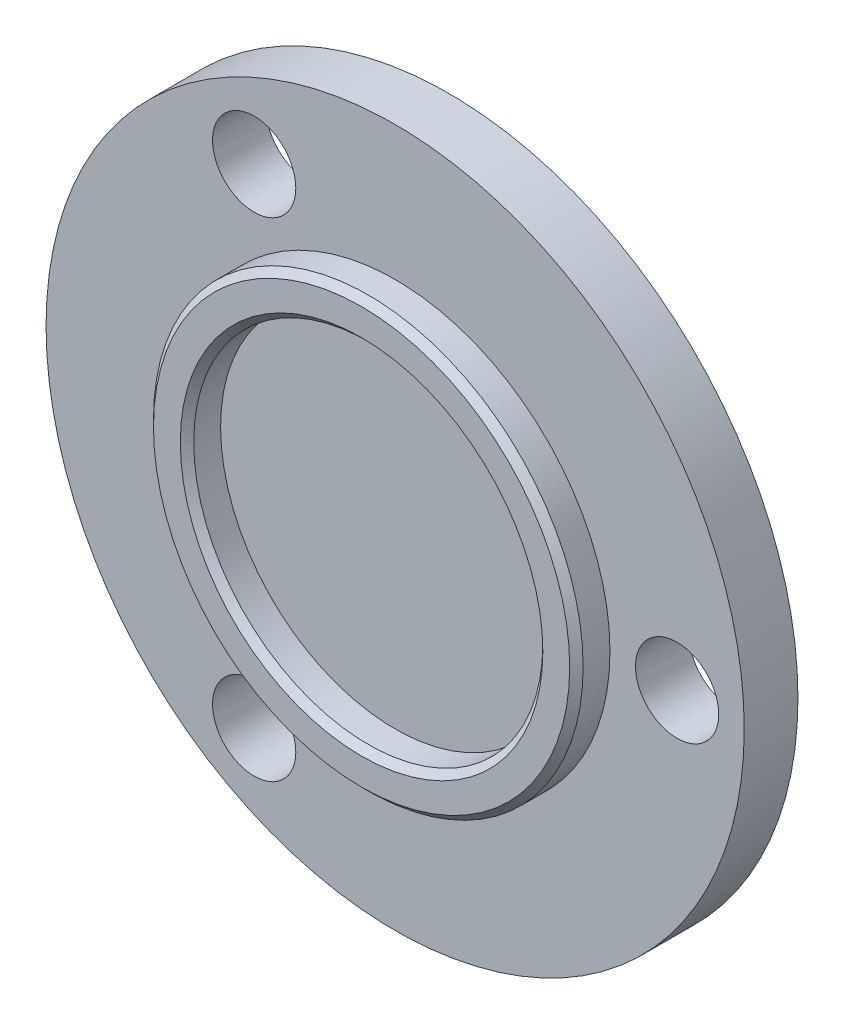
ISO-10303-21;
HEADER;
FILE_DESCRIPTION(('STEP AP214'),'2;1');
FILE_NAME('part.step','',(''),(''),'','','');
FILE_SCHEMA(('AUTOMOTIVE_DESIGN { 1 0 10303 214 1 1 1 1 }'));
ENDSEC;
DATA;
#1=APPLICATION_CONTEXT('core data for automotive mechanical design processes');
#2=APPLICATION_PROTOCOL_DEFINITION('international standard','automotive_design',2000,#1);
#3=PRODUCT_CONTEXT('',#1,'mechanical');
#4=PRODUCT('Part','Part','',(#3));
#5=PRODUCT_RELATED_PRODUCT_CATEGORY('part','',(#4));
#6=PRODUCT_DEFINITION_FORMATION('','',#4);
#7=PRODUCT_DEFINITION_CONTEXT('part definition',#1,'design');
#8=PRODUCT_DEFINITION('design','',#6,#7);
#9=PRODUCT_DEFINITION_SHAPE('','',#8);
#10=(LENGTH_UNIT() NAMED_UNIT(*) SI_UNIT(.MILLI.,.METRE.));
#11=(NAMED_UNIT(*) PLANE_ANGLE_UNIT() SI_UNIT($,.RADIAN.));
#12=(NAMED_UNIT(*) SI_UNIT($,.STERADIAN.) SOLID_ANGLE_UNIT());
#13=UNCERTAINTY_MEASURE_WITH_UNIT(LENGTH_MEASURE(1.E-05),#10,'distance_accuracy_value','');
#14=(GEOMETRIC_REPRESENTATION_CONTEXT(3) GLOBAL_UNCERTAINTY_ASSIGNED_CONTEXT((#13)) GLOBAL_UNIT_ASSIGNED_CONTEXT((#10,
#11,#12)) REPRESENTATION_CONTEXT('',''));
#15=CARTESIAN_POINT('',(0.,0.,0.));
#16=DIRECTION('',(0.,0.,1.));
#17=DIRECTION('',(1.,0.,0.));
#18=AXIS2_PLACEMENT_3D('',#15,#16,#17);
#19=CARTESIAN_POINT('',(0.,0.,4.));
#20=DIRECTION('',(0.,0.,-1.));
#21=DIRECTION('',(-1.,0.,0.));
#22=AXIS2_PLACEMENT_3D('',#19,#20,#21);
#23=CYLINDRICAL_SURFACE('',#22,26.);
#24=CARTESIAN_POINT('',(0.,0.,4.));
#25=DIRECTION('',(0.,0.,1.));
#26=DIRECTION('',(1.,0.,0.));
#27=AXIS2_PLACEMENT_3D('',#24,#25,#26);
#28=CIRCLE('',#27,26.);
#29=CARTESIAN_POINT('',(26.,0.,4.));
#30=VERTEX_POINT('',#29);
#31=EDGE_CURVE('E68',#30,#30,#28,.T.);
#32=ORIENTED_EDGE('',*,*,#31,.F.);
#33=EDGE_LOOP('',(#32));
#34=FACE_BOUND('',#33,.T.);
#35=CARTESIAN_POINT('',(0.,0.,0.));
#36=DIRECTION('',(0.,0.,1.));
#37=DIRECTION('',(1.,0.,0.));
#38=AXIS2_PLACEMENT_3D('',#35,#36,#37);
#39=CIRCLE('',#38,26.);
#40=CARTESIAN_POINT('',(26.,0.,0.));
#41=VERTEX_POINT('',#40);
#42=EDGE_CURVE('E69',#41,#41,#39,.T.);
#43=ORIENTED_EDGE('',*,*,#42,.T.);
#44=EDGE_LOOP('',(#43));
#45=FACE_BOUND('',#44,.T.);
#46=ADVANCED_FACE('F39',(#34,#45),#23,.T.);
#47=CARTESIAN_POINT('',(0.,0.,4.));
#48=DIRECTION('',(0.,0.,1.));
#49=DIRECTION('',(1.,0.,0.));
#50=AXIS2_PLACEMENT_3D('',#47,#48,#49);
#51=PLANE('',#50);
#52=CARTESIAN_POINT('',(0.,0.,4.));
#53=DIRECTION('',(0.,0.,1.));
#54=DIRECTION('',(1.,0.,0.));
#55=AXIS2_PLACEMENT_3D('',#52,#53,#54);
#56=CIRCLE('',#55,16.);
#57=CARTESIAN_POINT('',(16.,0.,4.));
#58=VERTEX_POINT('',#57);
#59=EDGE_CURVE('E82',#58,#58,#56,.T.);
#60=ORIENTED_EDGE('',*,*,#59,.F.);
#61=EDGE_LOOP('',(#60));
#62=FACE_BOUND('',#61,.T.);
#63=CARTESIAN_POINT('',(-10.5000000000001,-18.1865334794732,4.));
#64=DIRECTION('',(0.,0.,1.));
#65=DIRECTION('',(1.,0.,0.));
#66=AXIS2_PLACEMENT_3D('',#63,#64,#65);
#67=CIRCLE('',#66,3.1);
#68=CARTESIAN_POINT('',(-7.40000000000009,-18.1865334794732,4.));
#69=VERTEX_POINT('',#68);
#70=EDGE_CURVE('E94',#69,#69,#67,.T.);
#71=ORIENTED_EDGE('',*,*,#70,.F.);
#72=EDGE_LOOP('',(#71));
#73=FACE_BOUND('',#72,.T.);
#74=CARTESIAN_POINT('',(21.,0.,4.));
#75=DIRECTION('',(0.,0.,1.));
#76=DIRECTION('',(1.,0.,0.));
#77=AXIS2_PLACEMENT_3D('',#74,#75,#76);
#78=CIRCLE('',#77,3.1);
#79=CARTESIAN_POINT('',(24.1,0.,4.));
#80=VERTEX_POINT('',#79);
#81=EDGE_CURVE('E90',#80,#80,#78,.T.);
#82=ORIENTED_EDGE('',*,*,#81,.F.);
#83=EDGE_LOOP('',(#82));
#84=FACE_BOUND('',#83,.T.);
#85=CARTESIAN_POINT('',(-10.4999999999998,18.1865334794733,4.));
#86=DIRECTION('',(0.,0.,1.));
#87=DIRECTION('',(1.,0.,0.));
#88=AXIS2_PLACEMENT_3D('',#85,#86,#87);
#89=CIRCLE('',#88,3.1);
#90=CARTESIAN_POINT('',(-7.39999999999984,18.1865334794733,4.));
#91=VERTEX_POINT('',#90);
#92=EDGE_CURVE('E81',#91,#91,#89,.T.);
#93=ORIENTED_EDGE('',*,*,#92,.F.);
#94=EDGE_LOOP('',(#93));
#95=FACE_BOUND('',#94,.T.);
#96=ORIENTED_EDGE('',*,*,#31,.T.);
#97=EDGE_LOOP('',(#96));
#98=FACE_BOUND('',#97,.T.);
#99=ADVANCED_FACE('F107',(#62,#73,#84,#95,#98),#51,.T.);
#100=CARTESIAN_POINT('',(0.,0.,0.));
#101=DIRECTION('',(0.,0.,1.));
#102=DIRECTION('',(1.,0.,0.));
#103=AXIS2_PLACEMENT_3D('',#100,#101,#102);
#104=PLANE('',#103);
#105=CARTESIAN_POINT('',(-10.5000000000001,-18.1865334794732,0.));
#106=DIRECTION('',(0.,0.,1.));
#107=DIRECTION('',(1.,0.,0.));
#108=AXIS2_PLACEMENT_3D('',#105,#106,#107);
#109=CIRCLE('',#108,3.1);
#110=CARTESIAN_POINT('',(-7.40000000000009,-18.1865334794732,0.));
#111=VERTEX_POINT('',#110);
#112=EDGE_CURVE('E73',#111,#111,#109,.T.);
#113=ORIENTED_EDGE('',*,*,#112,.T.);
#114=EDGE_LOOP('',(#113));
#115=FACE_BOUND('',#114,.T.);
#116=CARTESIAN_POINT('',(21.,0.,0.));
#117=DIRECTION('',(0.,0.,1.));
#118=DIRECTION('',(1.,0.,0.));
#119=AXIS2_PLACEMENT_3D('',#116,#117,#118);
#120=CIRCLE('',#119,3.1);
#121=CARTESIAN_POINT('',(24.1,0.,0.));
#122=VERTEX_POINT('',#121);
#123=EDGE_CURVE('E86',#122,#122,#120,.T.);
#124=ORIENTED_EDGE('',*,*,#123,.T.);
#125=EDGE_LOOP('',(#124));
#126=FACE_BOUND('',#125,.T.);
#127=CARTESIAN_POINT('',(-10.4999999999998,18.1865334794733,0.));
#128=DIRECTION('',(0.,0.,1.));
#129=DIRECTION('',(1.,0.,0.));
#130=AXIS2_PLACEMENT_3D('',#127,#128,#129);
#131=CIRCLE('',#130,3.1);
#132=CARTESIAN_POINT('',(-7.39999999999984,18.1865334794733,0.));
#133=VERTEX_POINT('',#132);
#134=EDGE_CURVE('E77',#133,#133,#131,.T.);
#135=ORIENTED_EDGE('',*,*,#134,.T.);
#136=EDGE_LOOP('',(#135));
#137=FACE_BOUND('',#136,.T.);
#138=ORIENTED_EDGE('',*,*,#42,.F.);
#139=EDGE_LOOP('',(#138));
#140=FACE_BOUND('',#139,.T.);
#141=ADVANCED_FACE('F110',(#115,#126,#137,#140),#104,.F.);
#142=CARTESIAN_POINT('',(-10.4999999999998,18.1865334794733,0.));
#143=DIRECTION('',(0.,0.,1.));
#144=DIRECTION('',(1.,0.,0.));
#145=AXIS2_PLACEMENT_3D('',#142,#143,#144);
#146=CYLINDRICAL_SURFACE('',#145,3.1);
#147=ORIENTED_EDGE('',*,*,#134,.F.);
#148=EDGE_LOOP('',(#147));
#149=FACE_BOUND('',#148,.T.);
#150=ORIENTED_EDGE('',*,*,#92,.T.);
#151=EDGE_LOOP('',(#150));
#152=FACE_BOUND('',#151,.T.);
#153=ADVANCED_FACE('F127',(#149,#152),#146,.F.);
#154=CARTESIAN_POINT('',(21.,0.,0.));
#155=DIRECTION('',(0.,0.,1.));
#156=DIRECTION('',(1.,0.,0.));
#157=AXIS2_PLACEMENT_3D('',#154,#155,#156);
#158=CYLINDRICAL_SURFACE('',#157,3.1);
#159=ORIENTED_EDGE('',*,*,#123,.F.);
#160=EDGE_LOOP('',(#159));
#161=FACE_BOUND('',#160,.T.);
#162=ORIENTED_EDGE('',*,*,#81,.T.);
#163=EDGE_LOOP('',(#162));
#164=FACE_BOUND('',#163,.T.);
#165=ADVANCED_FACE('F133',(#161,#164),#158,.F.);
#166=CARTESIAN_POINT('',(-10.5000000000001,-18.1865334794732,0.));
#167=DIRECTION('',(0.,0.,1.));
#168=DIRECTION('',(1.,0.,0.));
#169=AXIS2_PLACEMENT_3D('',#166,#167,#168);
#170=CYLINDRICAL_SURFACE('',#169,3.1);
#171=ORIENTED_EDGE('',*,*,#112,.F.);
#172=EDGE_LOOP('',(#171));
#173=FACE_BOUND('',#172,.T.);
#174=ORIENTED_EDGE('',*,*,#70,.T.);
#175=EDGE_LOOP('',(#174));
#176=FACE_BOUND('',#175,.T.);
#177=ADVANCED_FACE('F156',(#173,#176),#170,.F.);
#178=CARTESIAN_POINT('',(0.,0.,6.5));
#179=DIRECTION('',(0.,0.,1.));
#180=DIRECTION('',(1.,0.,0.));
#181=AXIS2_PLACEMENT_3D('',#178,#179,#180);
#182=PLANE('',#181);
#183=CARTESIAN_POINT('',(0.,0.,6.5));
#184=DIRECTION('',(0.,0.,1.));
#185=DIRECTION('',(1.,0.,0.));
#186=AXIS2_PLACEMENT_3D('',#183,#184,#185);
#187=CIRCLE('',#186,13.5);
#188=CARTESIAN_POINT('',(13.5,0.,6.5));
#189=VERTEX_POINT('',#188);
#190=EDGE_CURVE('E10',#189,#189,#187,.F.);
#191=ORIENTED_EDGE('',*,*,#190,.T.);
#192=EDGE_LOOP('',(#191));
#193=FACE_BOUND('',#192,.T.);
#194=CARTESIAN_POINT('',(0.,0.,6.5));
#195=DIRECTION('',(0.,0.,1.));
#196=DIRECTION('',(1.,0.,0.));
#197=AXIS2_PLACEMENT_3D('',#194,#195,#196);
#198=CIRCLE('',#197,15.5);
#199=CARTESIAN_POINT('',(15.5,0.,6.5));
#200=VERTEX_POINT('',#199);
#201=EDGE_CURVE('E58',#200,#200,#198,.T.);
#202=ORIENTED_EDGE('',*,*,#201,.T.);
#203=EDGE_LOOP('',(#202));
#204=FACE_BOUND('',#203,.T.);
#205=ADVANCED_FACE('F154',(#193,#204),#182,.T.);
#206=CARTESIAN_POINT('',(0.,0.,6.5));
#207=DIRECTION('',(0.,0.,-1.));
#208=DIRECTION('',(-1.,0.,0.));
#209=AXIS2_PLACEMENT_3D('',#206,#207,#208);
#210=CYLINDRICAL_SURFACE('',#209,16.);
#211=CARTESIAN_POINT('',(0.,0.,5.99999999999999));
#212=DIRECTION('',(0.,0.,1.));
#213=DIRECTION('',(1.,0.,0.));
#214=AXIS2_PLACEMENT_3D('',#211,#212,#213);
#215=CIRCLE('',#214,16.);
#216=CARTESIAN_POINT('',(16.,0.,5.99999999999999));
#217=VERTEX_POINT('',#216);
#218=EDGE_CURVE('E53',#217,#217,#215,.F.);
#219=ORIENTED_EDGE('',*,*,#218,.T.);
#220=EDGE_LOOP('',(#219));
#221=FACE_BOUND('',#220,.T.);
#222=ORIENTED_EDGE('',*,*,#59,.T.);
#223=EDGE_LOOP('',(#222));
#224=FACE_BOUND('',#223,.T.);
#225=ADVANCED_FACE('F105',(#221,#224),#210,.T.);
#226=CARTESIAN_POINT('',(0.,0.,6.5));
#227=DIRECTION('',(0.,0.,-1.));
#228=DIRECTION('',(-1.,0.,0.));
#229=AXIS2_PLACEMENT_3D('',#226,#227,#228);
#230=CYLINDRICAL_SURFACE('',#229,13.);
#231=CARTESIAN_POINT('',(0.,0.,6.));
#232=DIRECTION('',(0.,0.,1.));
#233=DIRECTION('',(1.,0.,0.));
#234=AXIS2_PLACEMENT_3D('',#231,#232,#233);
#235=CIRCLE('',#234,13.);
#236=CARTESIAN_POINT('',(13.,0.,6.));
#237=VERTEX_POINT('',#236);
#238=EDGE_CURVE('E48',#237,#237,#235,.T.);
#239=ORIENTED_EDGE('',*,*,#238,.T.);
#240=EDGE_LOOP('',(#239));
#241=FACE_BOUND('',#240,.T.);
#242=CARTESIAN_POINT('',(0.,0.,4.));
#243=DIRECTION('',(0.,0.,1.));
#244=DIRECTION('',(1.,0.,0.));
#245=AXIS2_PLACEMENT_3D('',#242,#243,#244);
#246=CIRCLE('',#245,13.);
#247=CARTESIAN_POINT('',(13.,0.,4.));
#248=VERTEX_POINT('',#247);
#249=EDGE_CURVE('E64',#248,#248,#246,.F.);
#250=ORIENTED_EDGE('',*,*,#249,.T.);
#251=EDGE_LOOP('',(#250));
#252=FACE_BOUND('',#251,.T.);
#253=ADVANCED_FACE('F148',(#241,#252),#230,.F.);
#254=ORIENTED_EDGE('',*,*,#249,.F.);
#255=EDGE_LOOP('',(#254));
#256=FACE_BOUND('',#255,.T.);
#257=ADVANCED_FACE('F112',(#256),#51,.T.);
#258=CARTESIAN_POINT('',(0.,0.,6.5));
#259=DIRECTION('',(0.,0.,-1.));
#260=DIRECTION('',(-1.,0.,0.));
#261=AXIS2_PLACEMENT_3D('',#258,#259,#260);
#262=CONICAL_SURFACE('',#261,15.5,0.785398163397441);
#263=ORIENTED_EDGE('',*,*,#218,.F.);
#264=EDGE_LOOP('',(#263));
#265=FACE_BOUND('',#264,.T.);
#266=ORIENTED_EDGE('',*,*,#201,.F.);
#267=EDGE_LOOP('',(#266));
#268=FACE_BOUND('',#267,.T.);
#269=ADVANCED_FACE('F138',(#265,#268),#262,.T.);
#270=CARTESIAN_POINT('',(0.,0.,6.));
#271=DIRECTION('',(0.,0.,1.));
#272=DIRECTION('',(1.,0.,0.));
#273=AXIS2_PLACEMENT_3D('',#270,#271,#272);
#274=CONICAL_SURFACE('',#273,13.,0.785398163397445);
#275=ORIENTED_EDGE('',*,*,#190,.F.);
#276=EDGE_LOOP('',(#275));
#277=FACE_BOUND('',#276,.T.);
#278=ORIENTED_EDGE('',*,*,#238,.F.);
#279=EDGE_LOOP('',(#278));
#280=FACE_BOUND('',#279,.T.);
#281=ADVANCED_FACE('F42',(#277,#280),#274,.F.);
#282=CLOSED_SHELL('',(#46,#99,#141,#153,#165,#177,#205,#225,#253,#257,#269,#281));
#283=MANIFOLD_SOLID_BREP('B2',#282);
#284=ADVANCED_BREP_SHAPE_REPRESENTATION('',(#18,#283),#14);
#285=SHAPE_DEFINITION_REPRESENTATION(#9,#284);
ENDSEC;
END-ISO-10303-21;
